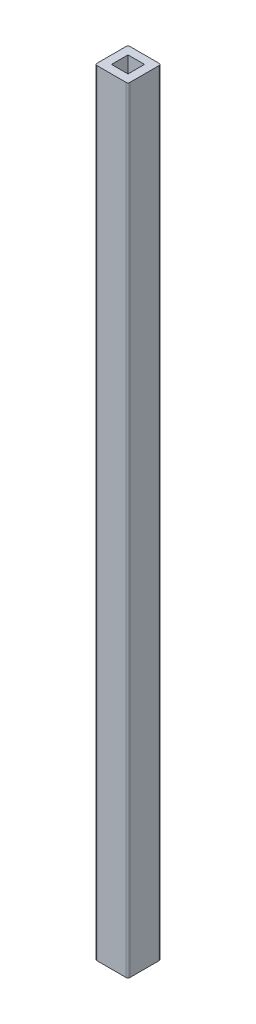
ISO-10303-21;
HEADER;
FILE_DESCRIPTION(('STEP AP214'),'2;1');
FILE_NAME('part.step','',(''),(''),'','','');
FILE_SCHEMA(('AUTOMOTIVE_DESIGN { 1 0 10303 214 1 1 1 1 }'));
ENDSEC;
DATA;
#1=APPLICATION_CONTEXT('core data for automotive mechanical design processes');
#2=APPLICATION_PROTOCOL_DEFINITION('international standard','automotive_design',2000,#1);
#3=PRODUCT_CONTEXT('',#1,'mechanical');
#4=PRODUCT('Part','Part','',(#3));
#5=PRODUCT_RELATED_PRODUCT_CATEGORY('part','',(#4));
#6=PRODUCT_DEFINITION_FORMATION('','',#4);
#7=PRODUCT_DEFINITION_CONTEXT('part definition',#1,'design');
#8=PRODUCT_DEFINITION('design','',#6,#7);
#9=PRODUCT_DEFINITION_SHAPE('','',#8);
#10=(LENGTH_UNIT() NAMED_UNIT(*) SI_UNIT(.MILLI.,.METRE.));
#11=(NAMED_UNIT(*) PLANE_ANGLE_UNIT() SI_UNIT($,.RADIAN.));
#12=(NAMED_UNIT(*) SI_UNIT($,.STERADIAN.) SOLID_ANGLE_UNIT());
#13=UNCERTAINTY_MEASURE_WITH_UNIT(LENGTH_MEASURE(1.E-05),#10,'distance_accuracy_value','');
#14=(GEOMETRIC_REPRESENTATION_CONTEXT(3) GLOBAL_UNCERTAINTY_ASSIGNED_CONTEXT((#13)) GLOBAL_UNIT_ASSIGNED_CONTEXT((#10,
#11,#12)) REPRESENTATION_CONTEXT('',''));
#15=CARTESIAN_POINT('',(0.,0.,0.));
#16=DIRECTION('',(0.,0.,1.));
#17=DIRECTION('',(1.,0.,0.));
#18=AXIS2_PLACEMENT_3D('',#15,#16,#17);
#19=CARTESIAN_POINT('',(0.,298.,0.));
#20=DIRECTION('',(0.,-1.,0.));
#21=DIRECTION('',(0.,0.,-1.));
#22=AXIS2_PLACEMENT_3D('',#19,#20,#21);
#23=PLANE('',#22);
#24=DIRECTION('',(-1.,0.,0.));
#25=VECTOR('',#24,1.);
#26=CARTESIAN_POINT('',(-12.7,298.,-12.7));
#27=LINE('',#26,#25);
#28=CARTESIAN_POINT('',(11.2,298.,-12.7));
#29=VERTEX_POINT('',#28);
#30=CARTESIAN_POINT('',(-11.2,298.,-12.7));
#31=VERTEX_POINT('',#30);
#32=EDGE_CURVE('E168',#29,#31,#27,.T.);
#33=ORIENTED_EDGE('',*,*,#32,.T.);
#34=CARTESIAN_POINT('',(-11.2,298.,-11.2));
#35=DIRECTION('',(0.,-1.,0.));
#36=DIRECTION('',(0.,0.,-1.));
#37=AXIS2_PLACEMENT_3D('',#34,#35,#36);
#38=CIRCLE('',#37,1.5);
#39=CARTESIAN_POINT('',(-12.7,298.,-11.2));
#40=VERTEX_POINT('',#39);
#41=EDGE_CURVE('E208',#31,#40,#38,.F.);
#42=ORIENTED_EDGE('',*,*,#41,.T.);
#43=DIRECTION('',(0.,0.,1.));
#44=VECTOR('',#43,1.);
#45=CARTESIAN_POINT('',(-12.7,298.,12.7));
#46=LINE('',#45,#44);
#47=CARTESIAN_POINT('',(-12.7,298.,11.2));
#48=VERTEX_POINT('',#47);
#49=EDGE_CURVE('E172',#40,#48,#46,.T.);
#50=ORIENTED_EDGE('',*,*,#49,.T.);
#51=CARTESIAN_POINT('',(-11.2,298.,11.2));
#52=DIRECTION('',(0.,-1.,0.));
#53=DIRECTION('',(0.,0.,-1.));
#54=AXIS2_PLACEMENT_3D('',#51,#52,#53);
#55=CIRCLE('',#54,1.5);
#56=CARTESIAN_POINT('',(-11.2,298.,12.7));
#57=VERTEX_POINT('',#56);
#58=EDGE_CURVE('E54',#48,#57,#55,.F.);
#59=ORIENTED_EDGE('',*,*,#58,.T.);
#60=DIRECTION('',(1.,0.,0.));
#61=VECTOR('',#60,1.);
#62=CARTESIAN_POINT('',(-12.7,298.,12.7));
#63=LINE('',#62,#61);
#64=CARTESIAN_POINT('',(11.2,298.,12.7));
#65=VERTEX_POINT('',#64);
#66=EDGE_CURVE('E174',#57,#65,#63,.T.);
#67=ORIENTED_EDGE('',*,*,#66,.T.);
#68=CARTESIAN_POINT('',(11.2,298.,11.2));
#69=DIRECTION('',(0.,-1.,0.));
#70=DIRECTION('',(0.,0.,-1.));
#71=AXIS2_PLACEMENT_3D('',#68,#69,#70);
#72=CIRCLE('',#71,1.5);
#73=CARTESIAN_POINT('',(12.7,298.,11.2));
#74=VERTEX_POINT('',#73);
#75=EDGE_CURVE('E203',#65,#74,#72,.F.);
#76=ORIENTED_EDGE('',*,*,#75,.T.);
#77=DIRECTION('',(0.,0.,-1.));
#78=VECTOR('',#77,1.);
#79=CARTESIAN_POINT('',(12.7,298.,12.7));
#80=LINE('',#79,#78);
#81=CARTESIAN_POINT('',(12.7,298.,-11.2));
#82=VERTEX_POINT('',#81);
#83=EDGE_CURVE('E165',#74,#82,#80,.T.);
#84=ORIENTED_EDGE('',*,*,#83,.T.);
#85=CARTESIAN_POINT('',(11.2,298.,-11.2));
#86=DIRECTION('',(0.,-1.,0.));
#87=DIRECTION('',(0.,0.,-1.));
#88=AXIS2_PLACEMENT_3D('',#85,#86,#87);
#89=CIRCLE('',#88,1.5);
#90=EDGE_CURVE('E206',#82,#29,#89,.F.);
#91=ORIENTED_EDGE('',*,*,#90,.T.);
#92=EDGE_LOOP('',(#33,#42,#50,#59,#67,#76,#84,#91));
#93=FACE_BOUND('',#92,.T.);
#94=DIRECTION('',(0.,0.,1.));
#95=VECTOR('',#94,1.);
#96=CARTESIAN_POINT('',(-6.35,298.,6.35000000000002));
#97=LINE('',#96,#95);
#98=CARTESIAN_POINT('',(-6.35,298.,-6.34999999999998));
#99=VERTEX_POINT('',#98);
#100=CARTESIAN_POINT('',(-6.35,298.,6.35000000000002));
#101=VERTEX_POINT('',#100);
#102=EDGE_CURVE('E124',#99,#101,#97,.T.);
#103=ORIENTED_EDGE('',*,*,#102,.F.);
#104=DIRECTION('',(-1.,0.,0.));
#105=VECTOR('',#104,1.);
#106=CARTESIAN_POINT('',(-6.35,298.,-6.34999999999998));
#107=LINE('',#106,#105);
#108=CARTESIAN_POINT('',(6.35,298.,-6.34999999999998));
#109=VERTEX_POINT('',#108);
#110=EDGE_CURVE('E149',#109,#99,#107,.T.);
#111=ORIENTED_EDGE('',*,*,#110,.F.);
#112=DIRECTION('',(0.,0.,-1.));
#113=VECTOR('',#112,1.);
#114=CARTESIAN_POINT('',(6.35,298.,6.35000000000002));
#115=LINE('',#114,#113);
#116=CARTESIAN_POINT('',(6.35,298.,6.35000000000002));
#117=VERTEX_POINT('',#116);
#118=EDGE_CURVE('E147',#117,#109,#115,.T.);
#119=ORIENTED_EDGE('',*,*,#118,.F.);
#120=DIRECTION('',(1.,0.,0.));
#121=VECTOR('',#120,1.);
#122=CARTESIAN_POINT('',(-6.35,298.,6.35000000000002));
#123=LINE('',#122,#121);
#124=EDGE_CURVE('E134',#101,#117,#123,.T.);
#125=ORIENTED_EDGE('',*,*,#124,.F.);
#126=EDGE_LOOP('',(#103,#111,#119,#125));
#127=FACE_BOUND('',#126,.T.);
#128=ADVANCED_FACE('F33',(#93,#127),#23,.F.);
#129=CARTESIAN_POINT('',(0.,-298.,0.));
#130=DIRECTION('',(0.,-1.,0.));
#131=DIRECTION('',(0.,0.,-1.));
#132=AXIS2_PLACEMENT_3D('',#129,#130,#131);
#133=PLANE('',#132);
#134=DIRECTION('',(0.,0.,1.));
#135=VECTOR('',#134,1.);
#136=CARTESIAN_POINT('',(-12.7,-298.,12.7));
#137=LINE('',#136,#135);
#138=CARTESIAN_POINT('',(-12.7,-298.,-11.2));
#139=VERTEX_POINT('',#138);
#140=CARTESIAN_POINT('',(-12.7,-298.,11.2));
#141=VERTEX_POINT('',#140);
#142=EDGE_CURVE('E182',#139,#141,#137,.T.);
#143=ORIENTED_EDGE('',*,*,#142,.F.);
#144=CARTESIAN_POINT('',(-11.2,-298.,-11.2));
#145=DIRECTION('',(0.,-1.,0.));
#146=DIRECTION('',(0.,0.,-1.));
#147=AXIS2_PLACEMENT_3D('',#144,#145,#146);
#148=CIRCLE('',#147,1.5);
#149=CARTESIAN_POINT('',(-11.2,-298.,-12.7));
#150=VERTEX_POINT('',#149);
#151=EDGE_CURVE('E196',#139,#150,#148,.T.);
#152=ORIENTED_EDGE('',*,*,#151,.T.);
#153=DIRECTION('',(-1.,0.,0.));
#154=VECTOR('',#153,1.);
#155=CARTESIAN_POINT('',(-12.7,-298.,-12.7));
#156=LINE('',#155,#154);
#157=CARTESIAN_POINT('',(11.2,-298.,-12.7));
#158=VERTEX_POINT('',#157);
#159=EDGE_CURVE('E179',#158,#150,#156,.T.);
#160=ORIENTED_EDGE('',*,*,#159,.F.);
#161=CARTESIAN_POINT('',(11.2,-298.,-11.2));
#162=DIRECTION('',(0.,-1.,0.));
#163=DIRECTION('',(0.,0.,-1.));
#164=AXIS2_PLACEMENT_3D('',#161,#162,#163);
#165=CIRCLE('',#164,1.5);
#166=CARTESIAN_POINT('',(12.7,-298.,-11.2));
#167=VERTEX_POINT('',#166);
#168=EDGE_CURVE('E194',#158,#167,#165,.T.);
#169=ORIENTED_EDGE('',*,*,#168,.T.);
#170=DIRECTION('',(0.,0.,-1.));
#171=VECTOR('',#170,1.);
#172=CARTESIAN_POINT('',(12.7,-298.,12.7));
#173=LINE('',#172,#171);
#174=CARTESIAN_POINT('',(12.7,-298.,11.2));
#175=VERTEX_POINT('',#174);
#176=EDGE_CURVE('E142',#175,#167,#173,.T.);
#177=ORIENTED_EDGE('',*,*,#176,.F.);
#178=CARTESIAN_POINT('',(11.2,-298.,11.2));
#179=DIRECTION('',(0.,-1.,0.));
#180=DIRECTION('',(0.,0.,-1.));
#181=AXIS2_PLACEMENT_3D('',#178,#179,#180);
#182=CIRCLE('',#181,1.5);
#183=CARTESIAN_POINT('',(11.2,-298.,12.7));
#184=VERTEX_POINT('',#183);
#185=EDGE_CURVE('E190',#175,#184,#182,.T.);
#186=ORIENTED_EDGE('',*,*,#185,.T.);
#187=DIRECTION('',(1.,0.,0.));
#188=VECTOR('',#187,1.);
#189=CARTESIAN_POINT('',(-12.7,-298.,12.7));
#190=LINE('',#189,#188);
#191=CARTESIAN_POINT('',(-11.2,-298.,12.7));
#192=VERTEX_POINT('',#191);
#193=EDGE_CURVE('E169',#192,#184,#190,.T.);
#194=ORIENTED_EDGE('',*,*,#193,.F.);
#195=CARTESIAN_POINT('',(-11.2,-298.,11.2));
#196=DIRECTION('',(0.,-1.,0.));
#197=DIRECTION('',(0.,0.,-1.));
#198=AXIS2_PLACEMENT_3D('',#195,#196,#197);
#199=CIRCLE('',#198,1.5);
#200=EDGE_CURVE('E192',#192,#141,#199,.T.);
#201=ORIENTED_EDGE('',*,*,#200,.T.);
#202=EDGE_LOOP('',(#143,#152,#160,#169,#177,#186,#194,#201));
#203=FACE_BOUND('',#202,.T.);
#204=DIRECTION('',(-1.,0.,0.));
#205=VECTOR('',#204,1.);
#206=CARTESIAN_POINT('',(-6.35,-298.,-6.34999999999998));
#207=LINE('',#206,#205);
#208=CARTESIAN_POINT('',(6.35,-298.,-6.34999999999998));
#209=VERTEX_POINT('',#208);
#210=CARTESIAN_POINT('',(-6.35,-298.,-6.34999999999998));
#211=VERTEX_POINT('',#210);
#212=EDGE_CURVE('E135',#209,#211,#207,.T.);
#213=ORIENTED_EDGE('',*,*,#212,.T.);
#214=DIRECTION('',(0.,0.,1.));
#215=VECTOR('',#214,1.);
#216=CARTESIAN_POINT('',(-6.35,-298.,6.35000000000002));
#217=LINE('',#216,#215);
#218=CARTESIAN_POINT('',(-6.35,-298.,6.35000000000002));
#219=VERTEX_POINT('',#218);
#220=EDGE_CURVE('E153',#211,#219,#217,.T.);
#221=ORIENTED_EDGE('',*,*,#220,.T.);
#222=DIRECTION('',(1.,0.,0.));
#223=VECTOR('',#222,1.);
#224=CARTESIAN_POINT('',(-6.35,-298.,6.35000000000002));
#225=LINE('',#224,#223);
#226=CARTESIAN_POINT('',(6.35,-298.,6.35000000000002));
#227=VERTEX_POINT('',#226);
#228=EDGE_CURVE('E141',#219,#227,#225,.T.);
#229=ORIENTED_EDGE('',*,*,#228,.T.);
#230=DIRECTION('',(0.,0.,-1.));
#231=VECTOR('',#230,1.);
#232=CARTESIAN_POINT('',(6.35,-298.,6.35000000000002));
#233=LINE('',#232,#231);
#234=EDGE_CURVE('E156',#227,#209,#233,.T.);
#235=ORIENTED_EDGE('',*,*,#234,.T.);
#236=EDGE_LOOP('',(#213,#221,#229,#235));
#237=FACE_BOUND('',#236,.T.);
#238=ADVANCED_FACE('F232',(#203,#237),#133,.T.);
#239=CARTESIAN_POINT('',(12.7,298.,12.7));
#240=DIRECTION('',(-1.,0.,0.));
#241=DIRECTION('',(0.,0.,1.));
#242=AXIS2_PLACEMENT_3D('',#239,#240,#241);
#243=PLANE('',#242);
#244=ORIENTED_EDGE('',*,*,#176,.T.);
#245=DIRECTION('',(0.,-1.,0.));
#246=VECTOR('',#245,1.);
#247=CARTESIAN_POINT('',(12.7,298.,-11.2));
#248=LINE('',#247,#246);
#249=EDGE_CURVE('E213',#167,#82,#248,.F.);
#250=ORIENTED_EDGE('',*,*,#249,.T.);
#251=ORIENTED_EDGE('',*,*,#83,.F.);
#252=DIRECTION('',(0.,-1.,0.));
#253=VECTOR('',#252,1.);
#254=CARTESIAN_POINT('',(12.7,298.,11.2));
#255=LINE('',#254,#253);
#256=EDGE_CURVE('E210',#74,#175,#255,.T.);
#257=ORIENTED_EDGE('',*,*,#256,.T.);
#258=EDGE_LOOP('',(#244,#250,#251,#257));
#259=FACE_BOUND('',#258,.T.);
#260=ADVANCED_FACE('F217',(#259),#243,.F.);
#261=CARTESIAN_POINT('',(-12.7,298.,-12.7));
#262=DIRECTION('',(0.,0.,1.));
#263=DIRECTION('',(1.,0.,0.));
#264=AXIS2_PLACEMENT_3D('',#261,#262,#263);
#265=PLANE('',#264);
#266=ORIENTED_EDGE('',*,*,#159,.T.);
#267=DIRECTION('',(0.,-1.,0.));
#268=VECTOR('',#267,1.);
#269=CARTESIAN_POINT('',(-11.2,298.,-12.7));
#270=LINE('',#269,#268);
#271=EDGE_CURVE('E201',#150,#31,#270,.F.);
#272=ORIENTED_EDGE('',*,*,#271,.T.);
#273=ORIENTED_EDGE('',*,*,#32,.F.);
#274=DIRECTION('',(0.,-1.,0.));
#275=VECTOR('',#274,1.);
#276=CARTESIAN_POINT('',(11.2,298.,-12.7));
#277=LINE('',#276,#275);
#278=EDGE_CURVE('E198',#29,#158,#277,.T.);
#279=ORIENTED_EDGE('',*,*,#278,.T.);
#280=EDGE_LOOP('',(#266,#272,#273,#279));
#281=FACE_BOUND('',#280,.T.);
#282=ADVANCED_FACE('F228',(#281),#265,.F.);
#283=CARTESIAN_POINT('',(-12.7,298.,12.7));
#284=DIRECTION('',(1.,0.,0.));
#285=DIRECTION('',(0.,0.,-1.));
#286=AXIS2_PLACEMENT_3D('',#283,#284,#285);
#287=PLANE('',#286);
#288=ORIENTED_EDGE('',*,*,#49,.F.);
#289=DIRECTION('',(0.,-1.,0.));
#290=VECTOR('',#289,1.);
#291=CARTESIAN_POINT('',(-12.7,298.,-11.2));
#292=LINE('',#291,#290);
#293=EDGE_CURVE('E187',#40,#139,#292,.T.);
#294=ORIENTED_EDGE('',*,*,#293,.T.);
#295=ORIENTED_EDGE('',*,*,#142,.T.);
#296=DIRECTION('',(0.,-1.,0.));
#297=VECTOR('',#296,1.);
#298=CARTESIAN_POINT('',(-12.7,298.,11.2));
#299=LINE('',#298,#297);
#300=EDGE_CURVE('E176',#141,#48,#299,.F.);
#301=ORIENTED_EDGE('',*,*,#300,.T.);
#302=EDGE_LOOP('',(#288,#294,#295,#301));
#303=FACE_BOUND('',#302,.T.);
#304=ADVANCED_FACE('F240',(#303),#287,.F.);
#305=CARTESIAN_POINT('',(-12.7,298.,12.7));
#306=DIRECTION('',(0.,0.,-1.));
#307=DIRECTION('',(-1.,0.,0.));
#308=AXIS2_PLACEMENT_3D('',#305,#306,#307);
#309=PLANE('',#308);
#310=ORIENTED_EDGE('',*,*,#66,.F.);
#311=DIRECTION('',(0.,-1.,0.));
#312=VECTOR('',#311,1.);
#313=CARTESIAN_POINT('',(-11.2,298.,12.7));
#314=LINE('',#313,#312);
#315=EDGE_CURVE('E11',#57,#192,#314,.T.);
#316=ORIENTED_EDGE('',*,*,#315,.T.);
#317=ORIENTED_EDGE('',*,*,#193,.T.);
#318=DIRECTION('',(0.,-1.,0.));
#319=VECTOR('',#318,1.);
#320=CARTESIAN_POINT('',(11.2,298.,12.7));
#321=LINE('',#320,#319);
#322=EDGE_CURVE('E41',#184,#65,#321,.F.);
#323=ORIENTED_EDGE('',*,*,#322,.T.);
#324=EDGE_LOOP('',(#310,#316,#317,#323));
#325=FACE_BOUND('',#324,.T.);
#326=ADVANCED_FACE('F246',(#325),#309,.F.);
#327=CARTESIAN_POINT('',(-6.35,298.,6.35000000000002));
#328=DIRECTION('',(1.,0.,0.));
#329=DIRECTION('',(0.,0.,-1.));
#330=AXIS2_PLACEMENT_3D('',#327,#328,#329);
#331=PLANE('',#330);
#332=ORIENTED_EDGE('',*,*,#220,.F.);
#333=DIRECTION('',(0.,-1.,0.));
#334=VECTOR('',#333,1.);
#335=CARTESIAN_POINT('',(-6.35,298.,-6.34999999999998));
#336=LINE('',#335,#334);
#337=EDGE_CURVE('E130',#99,#211,#336,.T.);
#338=ORIENTED_EDGE('',*,*,#337,.F.);
#339=ORIENTED_EDGE('',*,*,#102,.T.);
#340=DIRECTION('',(0.,-1.,0.));
#341=VECTOR('',#340,1.);
#342=CARTESIAN_POINT('',(-6.35,298.,6.35000000000002));
#343=LINE('',#342,#341);
#344=EDGE_CURVE('E127',#101,#219,#343,.T.);
#345=ORIENTED_EDGE('',*,*,#344,.T.);
#346=EDGE_LOOP('',(#332,#338,#339,#345));
#347=FACE_BOUND('',#346,.T.);
#348=ADVANCED_FACE('F126',(#347),#331,.T.);
#349=CARTESIAN_POINT('',(-6.35,298.,6.35000000000002));
#350=DIRECTION('',(0.,0.,-1.));
#351=DIRECTION('',(-1.,0.,0.));
#352=AXIS2_PLACEMENT_3D('',#349,#350,#351);
#353=PLANE('',#352);
#354=ORIENTED_EDGE('',*,*,#228,.F.);
#355=ORIENTED_EDGE('',*,*,#344,.F.);
#356=ORIENTED_EDGE('',*,*,#124,.T.);
#357=DIRECTION('',(0.,-1.,0.));
#358=VECTOR('',#357,1.);
#359=CARTESIAN_POINT('',(6.35,298.,6.35000000000002));
#360=LINE('',#359,#358);
#361=EDGE_CURVE('E143',#117,#227,#360,.T.);
#362=ORIENTED_EDGE('',*,*,#361,.T.);
#363=EDGE_LOOP('',(#354,#355,#356,#362));
#364=FACE_BOUND('',#363,.T.);
#365=ADVANCED_FACE('F138',(#364),#353,.T.);
#366=CARTESIAN_POINT('',(6.35,298.,6.35000000000002));
#367=DIRECTION('',(-1.,0.,0.));
#368=DIRECTION('',(0.,0.,1.));
#369=AXIS2_PLACEMENT_3D('',#366,#367,#368);
#370=PLANE('',#369);
#371=ORIENTED_EDGE('',*,*,#234,.F.);
#372=ORIENTED_EDGE('',*,*,#361,.F.);
#373=ORIENTED_EDGE('',*,*,#118,.T.);
#374=DIRECTION('',(0.,-1.,0.));
#375=VECTOR('',#374,1.);
#376=CARTESIAN_POINT('',(6.35,298.,-6.34999999999998));
#377=LINE('',#376,#375);
#378=EDGE_CURVE('E162',#109,#209,#377,.T.);
#379=ORIENTED_EDGE('',*,*,#378,.T.);
#380=EDGE_LOOP('',(#371,#372,#373,#379));
#381=FACE_BOUND('',#380,.T.);
#382=ADVANCED_FACE('F302',(#381),#370,.T.);
#383=CARTESIAN_POINT('',(-6.35,298.,-6.34999999999998));
#384=DIRECTION('',(0.,0.,1.));
#385=DIRECTION('',(1.,0.,0.));
#386=AXIS2_PLACEMENT_3D('',#383,#384,#385);
#387=PLANE('',#386);
#388=ORIENTED_EDGE('',*,*,#212,.F.);
#389=ORIENTED_EDGE('',*,*,#378,.F.);
#390=ORIENTED_EDGE('',*,*,#110,.T.);
#391=ORIENTED_EDGE('',*,*,#337,.T.);
#392=EDGE_LOOP('',(#388,#389,#390,#391));
#393=FACE_BOUND('',#392,.T.);
#394=ADVANCED_FACE('F271',(#393),#387,.T.);
#395=CARTESIAN_POINT('',(-11.2,298.,-11.2));
#396=DIRECTION('',(0.,-1.,0.));
#397=DIRECTION('',(0.,0.,-1.));
#398=AXIS2_PLACEMENT_3D('',#395,#396,#397);
#399=CYLINDRICAL_SURFACE('',#398,1.5);
#400=ORIENTED_EDGE('',*,*,#41,.F.);
#401=ORIENTED_EDGE('',*,*,#271,.F.);
#402=ORIENTED_EDGE('',*,*,#151,.F.);
#403=ORIENTED_EDGE('',*,*,#293,.F.);
#404=EDGE_LOOP('',(#400,#401,#402,#403));
#405=FACE_BOUND('',#404,.T.);
#406=ADVANCED_FACE('F237',(#405),#399,.T.);
#407=CARTESIAN_POINT('',(11.2,298.,-11.2));
#408=DIRECTION('',(0.,-1.,0.));
#409=DIRECTION('',(0.,0.,-1.));
#410=AXIS2_PLACEMENT_3D('',#407,#408,#409);
#411=CYLINDRICAL_SURFACE('',#410,1.5);
#412=ORIENTED_EDGE('',*,*,#90,.F.);
#413=ORIENTED_EDGE('',*,*,#249,.F.);
#414=ORIENTED_EDGE('',*,*,#168,.F.);
#415=ORIENTED_EDGE('',*,*,#278,.F.);
#416=EDGE_LOOP('',(#412,#413,#414,#415));
#417=FACE_BOUND('',#416,.T.);
#418=ADVANCED_FACE('F225',(#417),#411,.T.);
#419=CARTESIAN_POINT('',(-11.2,298.,11.2));
#420=DIRECTION('',(0.,-1.,0.));
#421=DIRECTION('',(0.,0.,-1.));
#422=AXIS2_PLACEMENT_3D('',#419,#420,#421);
#423=CYLINDRICAL_SURFACE('',#422,1.5);
#424=ORIENTED_EDGE('',*,*,#58,.F.);
#425=ORIENTED_EDGE('',*,*,#300,.F.);
#426=ORIENTED_EDGE('',*,*,#200,.F.);
#427=ORIENTED_EDGE('',*,*,#315,.F.);
#428=EDGE_LOOP('',(#424,#425,#426,#427));
#429=FACE_BOUND('',#428,.T.);
#430=ADVANCED_FACE('F244',(#429),#423,.T.);
#431=CARTESIAN_POINT('',(11.2,298.,11.2));
#432=DIRECTION('',(0.,-1.,0.));
#433=DIRECTION('',(0.,0.,-1.));
#434=AXIS2_PLACEMENT_3D('',#431,#432,#433);
#435=CYLINDRICAL_SURFACE('',#434,1.5);
#436=ORIENTED_EDGE('',*,*,#75,.F.);
#437=ORIENTED_EDGE('',*,*,#322,.F.);
#438=ORIENTED_EDGE('',*,*,#185,.F.);
#439=ORIENTED_EDGE('',*,*,#256,.F.);
#440=EDGE_LOOP('',(#436,#437,#438,#439));
#441=FACE_BOUND('',#440,.T.);
#442=ADVANCED_FACE('F35',(#441),#435,.T.);
#443=CLOSED_SHELL('',(#128,#238,#260,#282,#304,#326,#348,#365,#382,#394,#406,#418,#430,#442));
#444=MANIFOLD_SOLID_BREP('B2',#443);
#445=ADVANCED_BREP_SHAPE_REPRESENTATION('',(#18,#444),#14);
#446=SHAPE_DEFINITION_REPRESENTATION(#9,#445);
ENDSEC;
END-ISO-10303-21;
